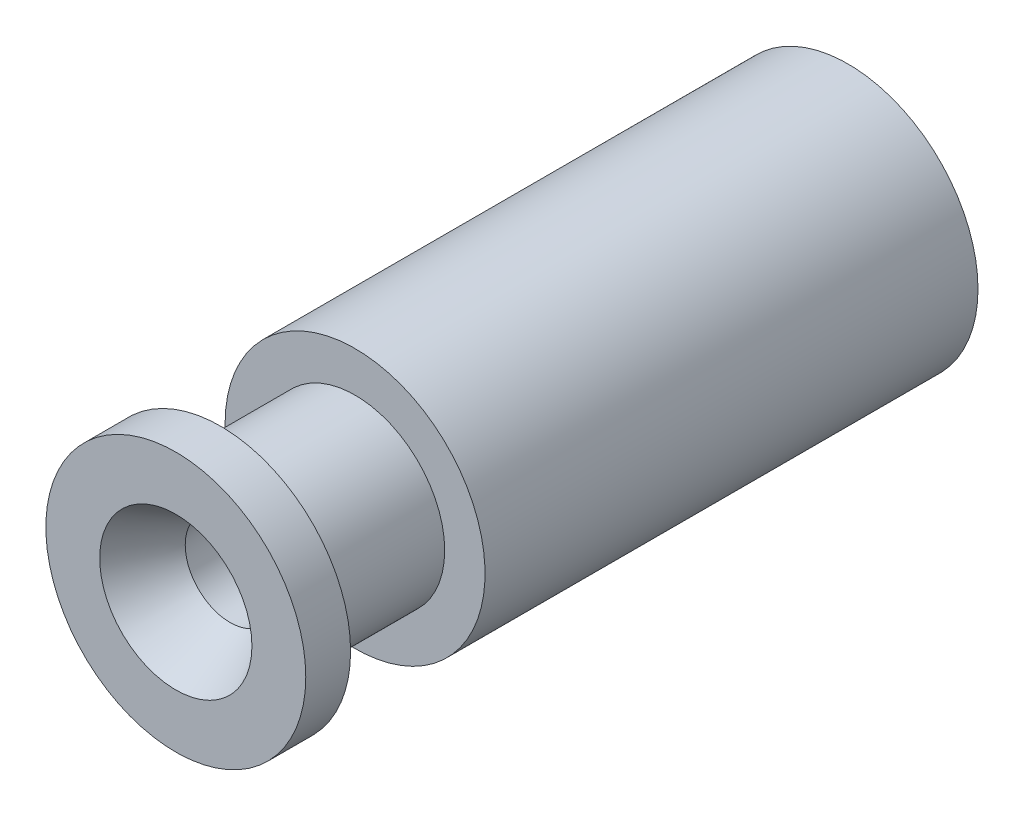
ISO-10303-21;
HEADER;
FILE_DESCRIPTION(('STEP AP214'),'2;1');
FILE_NAME('part.step','',(''),(''),'','','');
FILE_SCHEMA(('AUTOMOTIVE_DESIGN { 1 0 10303 214 1 1 1 1 }'));
ENDSEC;
DATA;
#1=APPLICATION_CONTEXT('core data for automotive mechanical design processes');
#2=APPLICATION_PROTOCOL_DEFINITION('international standard','automotive_design',2000,#1);
#3=PRODUCT_CONTEXT('',#1,'mechanical');
#4=PRODUCT('Part','Part','',(#3));
#5=PRODUCT_RELATED_PRODUCT_CATEGORY('part','',(#4));
#6=PRODUCT_DEFINITION_FORMATION('','',#4);
#7=PRODUCT_DEFINITION_CONTEXT('part definition',#1,'design');
#8=PRODUCT_DEFINITION('design','',#6,#7);
#9=PRODUCT_DEFINITION_SHAPE('','',#8);
#10=(LENGTH_UNIT() NAMED_UNIT(*) SI_UNIT(.MILLI.,.METRE.));
#11=(NAMED_UNIT(*) PLANE_ANGLE_UNIT() SI_UNIT($,.RADIAN.));
#12=(NAMED_UNIT(*) SI_UNIT($,.STERADIAN.) SOLID_ANGLE_UNIT());
#13=UNCERTAINTY_MEASURE_WITH_UNIT(LENGTH_MEASURE(1.E-05),#10,'distance_accuracy_value','');
#14=(GEOMETRIC_REPRESENTATION_CONTEXT(3) GLOBAL_UNCERTAINTY_ASSIGNED_CONTEXT((#13)) GLOBAL_UNIT_ASSIGNED_CONTEXT((#10,
#11,#12)) REPRESENTATION_CONTEXT('',''));
#15=CARTESIAN_POINT('',(0.,0.,0.));
#16=DIRECTION('',(0.,0.,1.));
#17=DIRECTION('',(1.,0.,0.));
#18=AXIS2_PLACEMENT_3D('',#15,#16,#17);
#19=CARTESIAN_POINT('',(0.,0.,15.));
#20=DIRECTION('',(0.,0.,-1.));
#21=DIRECTION('',(-1.,0.,0.));
#22=AXIS2_PLACEMENT_3D('',#19,#20,#21);
#23=CYLINDRICAL_SURFACE('',#22,2.9);
#24=CARTESIAN_POINT('',(0.,0.,14.));
#25=DIRECTION('',(0.,0.,1.));
#26=DIRECTION('',(1.,0.,0.));
#27=AXIS2_PLACEMENT_3D('',#24,#25,#26);
#28=CIRCLE('',#27,2.9);
#29=CARTESIAN_POINT('',(2.9,0.,14.));
#30=VERTEX_POINT('',#29);
#31=EDGE_CURVE('E52',#30,#30,#28,.T.);
#32=ORIENTED_EDGE('',*,*,#31,.T.);
#33=EDGE_LOOP('',(#32));
#34=FACE_BOUND('',#33,.T.);
#35=CARTESIAN_POINT('',(0.,0.,15.));
#36=DIRECTION('',(0.,0.,1.));
#37=DIRECTION('',(1.,0.,0.));
#38=AXIS2_PLACEMENT_3D('',#35,#36,#37);
#39=CIRCLE('',#38,2.9);
#40=CARTESIAN_POINT('',(2.9,0.,15.));
#41=VERTEX_POINT('',#40);
#42=EDGE_CURVE('E51',#41,#41,#39,.T.);
#43=ORIENTED_EDGE('',*,*,#42,.F.);
#44=EDGE_LOOP('',(#43));
#45=FACE_BOUND('',#44,.T.);
#46=ADVANCED_FACE('F31',(#34,#45),#23,.T.);
#47=CARTESIAN_POINT('',(0.,0.,11.));
#48=DIRECTION('',(0.,0.,-1.));
#49=DIRECTION('',(-1.,0.,0.));
#50=AXIS2_PLACEMENT_3D('',#47,#48,#49);
#51=CIRCLE('',#50,2.9);
#52=CARTESIAN_POINT('',(-2.9,0.,11.));
#53=VERTEX_POINT('',#52);
#54=EDGE_CURVE('E56',#53,#53,#51,.T.);
#55=ORIENTED_EDGE('',*,*,#54,.T.);
#56=EDGE_LOOP('',(#55));
#57=FACE_BOUND('',#56,.T.);
#58=CARTESIAN_POINT('',(0.,0.,0.));
#59=DIRECTION('',(0.,0.,1.));
#60=DIRECTION('',(1.,0.,0.));
#61=AXIS2_PLACEMENT_3D('',#58,#59,#60);
#62=CIRCLE('',#61,2.9);
#63=CARTESIAN_POINT('',(2.9,0.,0.));
#64=VERTEX_POINT('',#63);
#65=EDGE_CURVE('E63',#64,#64,#62,.T.);
#66=ORIENTED_EDGE('',*,*,#65,.T.);
#67=EDGE_LOOP('',(#66));
#68=FACE_BOUND('',#67,.T.);
#69=ADVANCED_FACE('F95',(#57,#68),#23,.T.);
#70=CARTESIAN_POINT('',(0.,0.,15.));
#71=DIRECTION('',(0.,0.,1.));
#72=DIRECTION('',(1.,0.,0.));
#73=AXIS2_PLACEMENT_3D('',#70,#71,#72);
#74=PLANE('',#73);
#75=CARTESIAN_POINT('',(0.,0.,15.));
#76=DIRECTION('',(0.,0.,1.));
#77=DIRECTION('',(1.,0.,0.));
#78=AXIS2_PLACEMENT_3D('',#75,#76,#77);
#79=CIRCLE('',#78,1.69859382571945);
#80=CARTESIAN_POINT('',(1.69859382571945,0.,15.));
#81=VERTEX_POINT('',#80);
#82=EDGE_CURVE('E38',#81,#81,#79,.F.);
#83=ORIENTED_EDGE('',*,*,#82,.T.);
#84=EDGE_LOOP('',(#83));
#85=FACE_BOUND('',#84,.T.);
#86=ORIENTED_EDGE('',*,*,#42,.T.);
#87=EDGE_LOOP('',(#86));
#88=FACE_BOUND('',#87,.T.);
#89=ADVANCED_FACE('F99',(#85,#88),#74,.T.);
#90=CARTESIAN_POINT('',(0.,0.,0.));
#91=DIRECTION('',(0.,0.,1.));
#92=DIRECTION('',(1.,0.,0.));
#93=AXIS2_PLACEMENT_3D('',#90,#91,#92);
#94=PLANE('',#93);
#95=CARTESIAN_POINT('',(0.,0.,0.));
#96=DIRECTION('',(0.,0.,1.));
#97=DIRECTION('',(1.,0.,0.));
#98=AXIS2_PLACEMENT_3D('',#95,#96,#97);
#99=CIRCLE('',#98,2.);
#100=CARTESIAN_POINT('',(2.,0.,0.));
#101=VERTEX_POINT('',#100);
#102=EDGE_CURVE('E42',#101,#101,#99,.T.);
#103=ORIENTED_EDGE('',*,*,#102,.T.);
#104=EDGE_LOOP('',(#103));
#105=FACE_BOUND('',#104,.T.);
#106=ORIENTED_EDGE('',*,*,#65,.F.);
#107=EDGE_LOOP('',(#106));
#108=FACE_BOUND('',#107,.T.);
#109=ADVANCED_FACE('F101',(#105,#108),#94,.F.);
#110=CARTESIAN_POINT('',(0.,0.,15.));
#111=DIRECTION('',(0.,0.,-1.));
#112=DIRECTION('',(-1.,0.,0.));
#113=AXIS2_PLACEMENT_3D('',#110,#111,#112);
#114=CYLINDRICAL_SURFACE('',#113,1.);
#115=CARTESIAN_POINT('',(0.,0.,13.79));
#116=DIRECTION('',(0.,0.,1.));
#117=DIRECTION('',(1.,0.,0.));
#118=AXIS2_PLACEMENT_3D('',#115,#116,#117);
#119=CIRCLE('',#118,1.);
#120=CARTESIAN_POINT('',(1.,0.,13.79));
#121=VERTEX_POINT('',#120);
#122=EDGE_CURVE('E10',#121,#121,#119,.T.);
#123=ORIENTED_EDGE('',*,*,#122,.T.);
#124=EDGE_LOOP('',(#123));
#125=FACE_BOUND('',#124,.T.);
#126=CARTESIAN_POINT('',(0.,0.,11.1502151547569));
#127=DIRECTION('',(0.,0.,-1.));
#128=DIRECTION('',(-1.,0.,0.));
#129=AXIS2_PLACEMENT_3D('',#126,#127,#128);
#130=CIRCLE('',#129,1.);
#131=CARTESIAN_POINT('',(-1.,0.,11.1502151547569));
#132=VERTEX_POINT('',#131);
#133=EDGE_CURVE('E60',#132,#132,#130,.T.);
#134=ORIENTED_EDGE('',*,*,#133,.T.);
#135=EDGE_LOOP('',(#134));
#136=FACE_BOUND('',#135,.T.);
#137=ADVANCED_FACE('F107',(#125,#136),#114,.F.);
#138=CARTESIAN_POINT('',(0.,0.,11.));
#139=DIRECTION('',(0.,0.,-1.));
#140=DIRECTION('',(-1.,0.,0.));
#141=AXIS2_PLACEMENT_3D('',#138,#139,#140);
#142=CONICAL_SURFACE('',#141,1.25,1.02974425867665);
#143=CARTESIAN_POINT('',(0.,0.,11.));
#144=DIRECTION('',(0.,0.,-1.));
#145=DIRECTION('',(-1.,0.,0.));
#146=AXIS2_PLACEMENT_3D('',#143,#144,#145);
#147=CIRCLE('',#146,1.25);
#148=CARTESIAN_POINT('',(-1.25,0.,11.));
#149=VERTEX_POINT('',#148);
#150=EDGE_CURVE('E55',#149,#149,#147,.T.);
#151=ORIENTED_EDGE('',*,*,#150,.T.);
#152=EDGE_LOOP('',(#151));
#153=FACE_BOUND('',#152,.T.);
#154=ORIENTED_EDGE('',*,*,#133,.F.);
#155=EDGE_LOOP('',(#154));
#156=FACE_BOUND('',#155,.T.);
#157=ADVANCED_FACE('F125',(#153,#156),#142,.F.);
#158=CARTESIAN_POINT('',(0.,0.,0.));
#159=DIRECTION('',(0.,0.,-1.));
#160=DIRECTION('',(-1.,0.,0.));
#161=AXIS2_PLACEMENT_3D('',#158,#159,#160);
#162=CYLINDRICAL_SURFACE('',#161,1.25);
#163=CARTESIAN_POINT('',(0.,0.,1.29903810567666));
#164=DIRECTION('',(0.,0.,1.));
#165=DIRECTION('',(1.,0.,0.));
#166=AXIS2_PLACEMENT_3D('',#163,#164,#165);
#167=CIRCLE('',#166,1.25);
#168=CARTESIAN_POINT('',(1.25,0.,1.29903810567666));
#169=VERTEX_POINT('',#168);
#170=EDGE_CURVE('E46',#169,#169,#167,.F.);
#171=ORIENTED_EDGE('',*,*,#170,.T.);
#172=EDGE_LOOP('',(#171));
#173=FACE_BOUND('',#172,.T.);
#174=ORIENTED_EDGE('',*,*,#150,.F.);
#175=EDGE_LOOP('',(#174));
#176=FACE_BOUND('',#175,.T.);
#177=ADVANCED_FACE('F89',(#173,#176),#162,.F.);
#178=CARTESIAN_POINT('',(0.,-3.79379159500485,14.));
#179=DIRECTION('',(0.,0.,1.));
#180=DIRECTION('',(1.,0.,0.));
#181=AXIS2_PLACEMENT_3D('',#178,#179,#180);
#182=PLANE('',#181);
#183=CARTESIAN_POINT('',(0.,0.,14.));
#184=DIRECTION('',(0.,0.,-1.));
#185=DIRECTION('',(-1.,0.,0.));
#186=AXIS2_PLACEMENT_3D('',#183,#184,#185);
#187=CIRCLE('',#186,2.);
#188=CARTESIAN_POINT('',(-2.,0.,14.));
#189=VERTEX_POINT('',#188);
#190=EDGE_CURVE('E59',#189,#189,#187,.T.);
#191=ORIENTED_EDGE('',*,*,#190,.F.);
#192=EDGE_LOOP('',(#191));
#193=FACE_BOUND('',#192,.T.);
#194=ORIENTED_EDGE('',*,*,#31,.F.);
#195=EDGE_LOOP('',(#194));
#196=FACE_BOUND('',#195,.T.);
#197=ADVANCED_FACE('F86',(#193,#196),#182,.F.);
#198=CARTESIAN_POINT('',(0.,-3.79379159500486,11.));
#199=DIRECTION('',(0.,0.,-1.));
#200=DIRECTION('',(-1.,0.,0.));
#201=AXIS2_PLACEMENT_3D('',#198,#199,#200);
#202=PLANE('',#201);
#203=CARTESIAN_POINT('',(0.,0.,11.));
#204=DIRECTION('',(0.,0.,-1.));
#205=DIRECTION('',(-1.,0.,0.));
#206=AXIS2_PLACEMENT_3D('',#203,#204,#205);
#207=CIRCLE('',#206,2.);
#208=CARTESIAN_POINT('',(-2.,0.,11.));
#209=VERTEX_POINT('',#208);
#210=EDGE_CURVE('E72',#209,#209,#207,.T.);
#211=ORIENTED_EDGE('',*,*,#210,.T.);
#212=EDGE_LOOP('',(#211));
#213=FACE_BOUND('',#212,.T.);
#214=ORIENTED_EDGE('',*,*,#54,.F.);
#215=EDGE_LOOP('',(#214));
#216=FACE_BOUND('',#215,.T.);
#217=ADVANCED_FACE('F76',(#213,#216),#202,.F.);
#218=CARTESIAN_POINT('',(0.,0.,0.));
#219=DIRECTION('',(0.,0.,-1.));
#220=DIRECTION('',(-1.,0.,0.));
#221=AXIS2_PLACEMENT_3D('',#218,#219,#220);
#222=CYLINDRICAL_SURFACE('',#221,2.);
#223=ORIENTED_EDGE('',*,*,#210,.F.);
#224=EDGE_LOOP('',(#223));
#225=FACE_BOUND('',#224,.T.);
#226=ORIENTED_EDGE('',*,*,#190,.T.);
#227=EDGE_LOOP('',(#226));
#228=FACE_BOUND('',#227,.T.);
#229=ADVANCED_FACE('F79',(#225,#228),#222,.T.);
#230=CARTESIAN_POINT('',(0.,0.,1.29903810567666));
#231=DIRECTION('',(0.,0.,-1.));
#232=DIRECTION('',(-1.,0.,0.));
#233=AXIS2_PLACEMENT_3D('',#230,#231,#232);
#234=CONICAL_SURFACE('',#233,1.25,0.5235987755983);
#235=ORIENTED_EDGE('',*,*,#102,.F.);
#236=EDGE_LOOP('',(#235));
#237=FACE_BOUND('',#236,.T.);
#238=ORIENTED_EDGE('',*,*,#170,.F.);
#239=EDGE_LOOP('',(#238));
#240=FACE_BOUND('',#239,.T.);
#241=ADVANCED_FACE('F82',(#237,#240),#234,.F.);
#242=CARTESIAN_POINT('',(0.,0.,15.));
#243=DIRECTION('',(0.,0.,1.));
#244=DIRECTION('',(1.,0.,0.));
#245=AXIS2_PLACEMENT_3D('',#242,#243,#244);
#246=CONICAL_SURFACE('',#245,1.69859382571945,0.523598775598297);
#247=ORIENTED_EDGE('',*,*,#122,.F.);
#248=EDGE_LOOP('',(#247));
#249=FACE_BOUND('',#248,.T.);
#250=ORIENTED_EDGE('',*,*,#82,.F.);
#251=EDGE_LOOP('',(#250));
#252=FACE_BOUND('',#251,.T.);
#253=ADVANCED_FACE('F33',(#249,#252),#246,.F.);
#254=CLOSED_SHELL('',(#46,#69,#89,#109,#137,#157,#177,#197,#217,#229,#241,#253));
#255=MANIFOLD_SOLID_BREP('B2',#254);
#256=ADVANCED_BREP_SHAPE_REPRESENTATION('',(#18,#255),#14);
#257=SHAPE_DEFINITION_REPRESENTATION(#9,#256);
ENDSEC;
END-ISO-10303-21;
